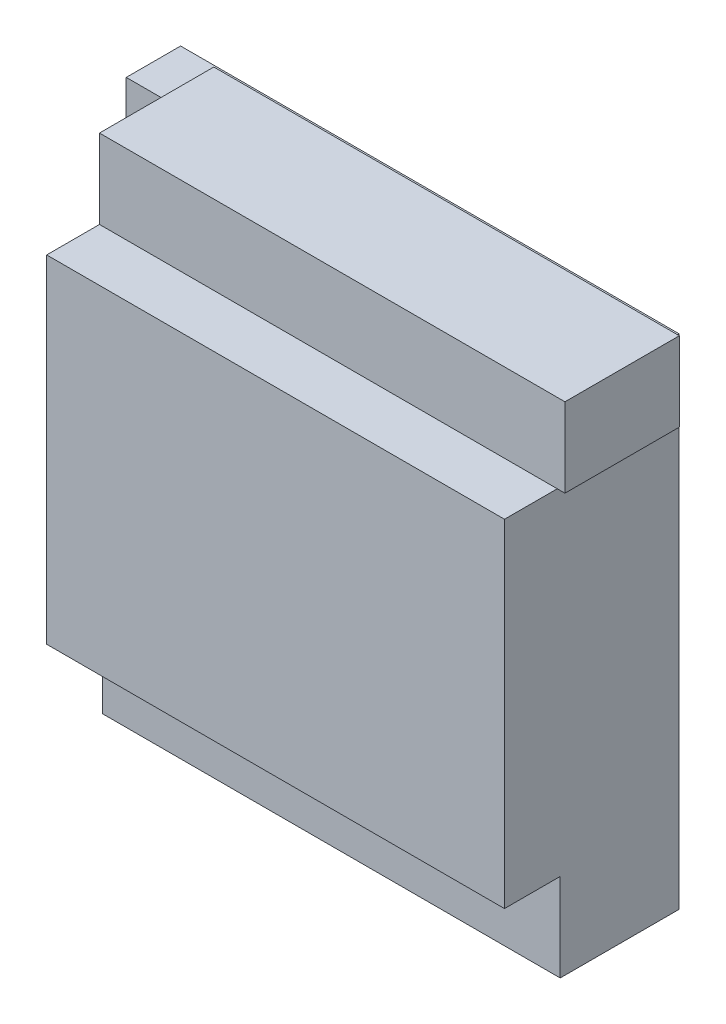
ISO-10303-21;
HEADER;
FILE_DESCRIPTION(('STEP AP214'),'2;1');
FILE_NAME('part.step','',(''),(''),'','','');
FILE_SCHEMA(('AUTOMOTIVE_DESIGN { 1 0 10303 214 1 1 1 1 }'));
ENDSEC;
DATA;
#1=APPLICATION_CONTEXT('core data for automotive mechanical design processes');
#2=APPLICATION_PROTOCOL_DEFINITION('international standard','automotive_design',2000,#1);
#3=PRODUCT_CONTEXT('',#1,'mechanical');
#4=PRODUCT('Part','Part','',(#3));
#5=PRODUCT_RELATED_PRODUCT_CATEGORY('part','',(#4));
#6=PRODUCT_DEFINITION_FORMATION('','',#4);
#7=PRODUCT_DEFINITION_CONTEXT('part definition',#1,'design');
#8=PRODUCT_DEFINITION('design','',#6,#7);
#9=PRODUCT_DEFINITION_SHAPE('','',#8);
#10=(LENGTH_UNIT() NAMED_UNIT(*) SI_UNIT(.MILLI.,.METRE.));
#11=(NAMED_UNIT(*) PLANE_ANGLE_UNIT() SI_UNIT($,.RADIAN.));
#12=(NAMED_UNIT(*) SI_UNIT($,.STERADIAN.) SOLID_ANGLE_UNIT());
#13=UNCERTAINTY_MEASURE_WITH_UNIT(LENGTH_MEASURE(1.E-05),#10,'distance_accuracy_value','');
#14=(GEOMETRIC_REPRESENTATION_CONTEXT(3) GLOBAL_UNCERTAINTY_ASSIGNED_CONTEXT((#13)) GLOBAL_UNIT_ASSIGNED_CONTEXT((#10,
#11,#12)) REPRESENTATION_CONTEXT('',''));
#15=CARTESIAN_POINT('',(0.,0.,0.));
#16=DIRECTION('',(0.,0.,1.));
#17=DIRECTION('',(1.,0.,0.));
#18=AXIS2_PLACEMENT_3D('',#15,#16,#17);
#19=CARTESIAN_POINT('',(-71.13,60.,41.54));
#20=DIRECTION('',(0.,1.,0.));
#21=DIRECTION('',(0.,0.,1.));
#22=AXIS2_PLACEMENT_3D('',#19,#20,#21);
#23=PLANE('',#22);
#24=DIRECTION('',(0.,0.,-1.));
#25=VECTOR('',#24,1.);
#26=CARTESIAN_POINT('',(85.,60.,59.54));
#27=LINE('',#26,#25);
#28=CARTESIAN_POINT('',(84.9999999999999,60.,41.54));
#29=VERTEX_POINT('',#28);
#30=CARTESIAN_POINT('',(84.9999999999999,60.,2.54));
#31=VERTEX_POINT('',#30);
#32=EDGE_CURVE('E531',#29,#31,#27,.T.);
#33=ORIENTED_EDGE('',*,*,#32,.T.);
#34=DIRECTION('',(1.,0.,0.));
#35=VECTOR('',#34,1.);
#36=CARTESIAN_POINT('',(-71.13,60.,2.54));
#37=LINE('',#36,#35);
#38=CARTESIAN_POINT('',(87.62,60.,2.54));
#39=VERTEX_POINT('',#38);
#40=EDGE_CURVE('E463',#31,#39,#37,.T.);
#41=ORIENTED_EDGE('',*,*,#40,.T.);
#42=DIRECTION('',(0.,0.,-1.));
#43=VECTOR('',#42,1.);
#44=CARTESIAN_POINT('',(87.62,60.,41.54));
#45=LINE('',#44,#43);
#46=CARTESIAN_POINT('',(87.62,60.,41.54));
#47=VERTEX_POINT('',#46);
#48=EDGE_CURVE('E476',#47,#39,#45,.T.);
#49=ORIENTED_EDGE('',*,*,#48,.F.);
#50=DIRECTION('',(1.,0.,0.));
#51=VECTOR('',#50,1.);
#52=CARTESIAN_POINT('',(-71.13,60.,41.54));
#53=LINE('',#52,#51);
#54=EDGE_CURVE('E50',#29,#47,#53,.T.);
#55=ORIENTED_EDGE('',*,*,#54,.F.);
#56=EDGE_LOOP('',(#33,#41,#49,#55));
#57=FACE_BOUND('',#56,.T.);
#58=ADVANCED_FACE('F35',(#57),#23,.F.);
#59=CARTESIAN_POINT('',(-71.13,60.,41.54));
#60=DIRECTION('',(1.,0.,0.));
#61=DIRECTION('',(0.,0.,-1.));
#62=AXIS2_PLACEMENT_3D('',#59,#60,#61);
#63=PLANE('',#62);
#64=DIRECTION('',(0.,0.,-1.));
#65=VECTOR('',#64,1.);
#66=CARTESIAN_POINT('',(-71.13,85.,18.54));
#67=LINE('',#66,#65);
#68=CARTESIAN_POINT('',(-71.13,85.,18.54));
#69=VERTEX_POINT('',#68);
#70=CARTESIAN_POINT('',(-71.13,85.,2.54));
#71=VERTEX_POINT('',#70);
#72=EDGE_CURVE('E440',#69,#71,#67,.T.);
#73=ORIENTED_EDGE('',*,*,#72,.F.);
#74=DIRECTION('',(0.,1.,0.));
#75=VECTOR('',#74,1.);
#76=CARTESIAN_POINT('',(-71.13,85.,18.54));
#77=LINE('',#76,#75);
#78=CARTESIAN_POINT('',(-71.13,-85.,18.54));
#79=VERTEX_POINT('',#78);
#80=EDGE_CURVE('E435',#79,#69,#77,.T.);
#81=ORIENTED_EDGE('',*,*,#80,.F.);
#82=DIRECTION('',(0.,0.,-1.));
#83=VECTOR('',#82,1.);
#84=CARTESIAN_POINT('',(-71.13,-85.,40.54));
#85=LINE('',#84,#83);
#86=CARTESIAN_POINT('',(-71.13,-85.,40.54));
#87=VERTEX_POINT('',#86);
#88=EDGE_CURVE('E427',#87,#79,#85,.T.);
#89=ORIENTED_EDGE('',*,*,#88,.F.);
#90=DIRECTION('',(0.,-1.,0.));
#91=VECTOR('',#90,1.);
#92=CARTESIAN_POINT('',(-71.13,-85.,40.54));
#93=LINE('',#92,#91);
#94=CARTESIAN_POINT('',(-71.13,-55.,40.54));
#95=VERTEX_POINT('',#94);
#96=EDGE_CURVE('E421',#95,#87,#93,.T.);
#97=ORIENTED_EDGE('',*,*,#96,.F.);
#98=DIRECTION('',(0.,0.,-1.));
#99=VECTOR('',#98,1.);
#100=CARTESIAN_POINT('',(-71.13,-55.,59.54));
#101=LINE('',#100,#99);
#102=CARTESIAN_POINT('',(-71.13,-55.,59.54));
#103=VERTEX_POINT('',#102);
#104=EDGE_CURVE('E409',#103,#95,#101,.T.);
#105=ORIENTED_EDGE('',*,*,#104,.F.);
#106=DIRECTION('',(0.,-1.,0.));
#107=VECTOR('',#106,1.);
#108=CARTESIAN_POINT('',(-71.13,60.,59.54));
#109=LINE('',#108,#107);
#110=CARTESIAN_POINT('',(-71.13,60.,59.54));
#111=VERTEX_POINT('',#110);
#112=EDGE_CURVE('E543',#111,#103,#109,.T.);
#113=ORIENTED_EDGE('',*,*,#112,.F.);
#114=DIRECTION('',(0.,0.,-1.));
#115=VECTOR('',#114,1.);
#116=CARTESIAN_POINT('',(-71.13,60.,59.54));
#117=LINE('',#116,#115);
#118=CARTESIAN_POINT('',(-71.13,60.,41.54));
#119=VERTEX_POINT('',#118);
#120=EDGE_CURVE('E517',#111,#119,#117,.T.);
#121=ORIENTED_EDGE('',*,*,#120,.T.);
#122=DIRECTION('',(0.,-1.,0.));
#123=VECTOR('',#122,1.);
#124=CARTESIAN_POINT('',(-71.13,60.,41.54));
#125=LINE('',#124,#123);
#126=CARTESIAN_POINT('',(-71.13,87.,41.54));
#127=VERTEX_POINT('',#126);
#128=EDGE_CURVE('E449',#127,#119,#125,.T.);
#129=ORIENTED_EDGE('',*,*,#128,.F.);
#130=DIRECTION('',(0.,0.,-1.));
#131=VECTOR('',#130,1.);
#132=CARTESIAN_POINT('',(-71.13,87.,41.54));
#133=LINE('',#132,#131);
#134=CARTESIAN_POINT('',(-71.13,87.,2.54));
#135=VERTEX_POINT('',#134);
#136=EDGE_CURVE('E461',#127,#135,#133,.T.);
#137=ORIENTED_EDGE('',*,*,#136,.T.);
#138=DIRECTION('',(0.,-1.,0.));
#139=VECTOR('',#138,1.);
#140=CARTESIAN_POINT('',(-71.13,60.,2.54));
#141=LINE('',#140,#139);
#142=EDGE_CURVE('E448',#135,#71,#141,.T.);
#143=ORIENTED_EDGE('',*,*,#142,.T.);
#144=EDGE_LOOP('',(#73,#81,#89,#97,#105,#113,#121,#129,#137,#143));
#145=FACE_BOUND('',#144,.T.);
#146=ADVANCED_FACE('F133',(#145),#63,.F.);
#147=CARTESIAN_POINT('',(0.,0.,0.));
#148=DIRECTION('',(0.,0.,-1.));
#149=DIRECTION('',(-1.,0.,0.));
#150=AXIS2_PLACEMENT_3D('',#147,#148,#149);
#151=PLANE('',#150);
#152=CARTESIAN_POINT('',(-78.65,-80.0999999999998,0.));
#153=DIRECTION('',(0.,0.,1.));
#154=DIRECTION('',(1.,0.,0.));
#155=AXIS2_PLACEMENT_3D('',#152,#153,#154);
#156=CIRCLE('',#155,1.97999999999999);
#157=CARTESIAN_POINT('',(-76.67,-80.0999999999998,0.));
#158=VERTEX_POINT('',#157);
#159=EDGE_CURVE('E482',#158,#158,#156,.T.);
#160=ORIENTED_EDGE('',*,*,#159,.T.);
#161=EDGE_LOOP('',(#160));
#162=FACE_BOUND('',#161,.T.);
#163=CARTESIAN_POINT('',(-78.65,74.84,0.));
#164=DIRECTION('',(0.,0.,1.));
#165=DIRECTION('',(1.,0.,0.));
#166=AXIS2_PLACEMENT_3D('',#163,#164,#165);
#167=CIRCLE('',#166,1.97999999999999);
#168=CARTESIAN_POINT('',(-76.67,74.84,0.));
#169=VERTEX_POINT('',#168);
#170=EDGE_CURVE('E120',#169,#169,#167,.T.);
#171=ORIENTED_EDGE('',*,*,#170,.T.);
#172=EDGE_LOOP('',(#171));
#173=FACE_BOUND('',#172,.T.);
#174=DIRECTION('',(0.,1.,0.));
#175=VECTOR('',#174,1.);
#176=CARTESIAN_POINT('',(85.,-85.,0.));
#177=LINE('',#176,#175);
#178=CARTESIAN_POINT('',(85.,-85.,0.));
#179=VERTEX_POINT('',#178);
#180=CARTESIAN_POINT('',(85.,85.,0.));
#181=VERTEX_POINT('',#180);
#182=EDGE_CURVE('E104',#179,#181,#177,.T.);
#183=ORIENTED_EDGE('',*,*,#182,.F.);
#184=DIRECTION('',(1.,0.,0.));
#185=VECTOR('',#184,1.);
#186=CARTESIAN_POINT('',(-85.,-85.,0.));
#187=LINE('',#186,#185);
#188=CARTESIAN_POINT('',(-85.,-85.,0.));
#189=VERTEX_POINT('',#188);
#190=EDGE_CURVE('E87',#189,#179,#187,.T.);
#191=ORIENTED_EDGE('',*,*,#190,.F.);
#192=DIRECTION('',(0.,-1.,0.));
#193=VECTOR('',#192,1.);
#194=CARTESIAN_POINT('',(-85.,-85.,0.));
#195=LINE('',#194,#193);
#196=CARTESIAN_POINT('',(-85.,85.,0.));
#197=VERTEX_POINT('',#196);
#198=EDGE_CURVE('E77',#197,#189,#195,.T.);
#199=ORIENTED_EDGE('',*,*,#198,.F.);
#200=DIRECTION('',(-1.,0.,0.));
#201=VECTOR('',#200,1.);
#202=CARTESIAN_POINT('',(-85.,85.,0.));
#203=LINE('',#202,#201);
#204=EDGE_CURVE('E88',#181,#197,#203,.T.);
#205=ORIENTED_EDGE('',*,*,#204,.F.);
#206=EDGE_LOOP('',(#183,#191,#199,#205));
#207=FACE_BOUND('',#206,.T.);
#208=CARTESIAN_POINT('',(78.8299999999999,51.98,0.));
#209=DIRECTION('',(0.,0.,1.));
#210=DIRECTION('',(1.,0.,0.));
#211=AXIS2_PLACEMENT_3D('',#208,#209,#210);
#212=CIRCLE('',#211,1.97999999999999);
#213=CARTESIAN_POINT('',(80.8099999999999,51.98,0.));
#214=VERTEX_POINT('',#213);
#215=EDGE_CURVE('E485',#214,#214,#212,.T.);
#216=ORIENTED_EDGE('',*,*,#215,.T.);
#217=EDGE_LOOP('',(#216));
#218=FACE_BOUND('',#217,.T.);
#219=CARTESIAN_POINT('',(78.8299999999999,-80.0999999999998,0.));
#220=DIRECTION('',(0.,0.,1.));
#221=DIRECTION('',(1.,0.,0.));
#222=AXIS2_PLACEMENT_3D('',#219,#220,#221);
#223=CIRCLE('',#222,1.97999999999999);
#224=CARTESIAN_POINT('',(80.8099999999999,-80.0999999999998,0.));
#225=VERTEX_POINT('',#224);
#226=EDGE_CURVE('E479',#225,#225,#223,.T.);
#227=ORIENTED_EDGE('',*,*,#226,.T.);
#228=EDGE_LOOP('',(#227));
#229=FACE_BOUND('',#228,.T.);
#230=ADVANCED_FACE('F101',(#162,#173,#207,#218,#229),#151,.T.);
#231=CARTESIAN_POINT('',(85.,-85.,2.54));
#232=DIRECTION('',(-1.,0.,0.));
#233=DIRECTION('',(0.,0.,1.));
#234=AXIS2_PLACEMENT_3D('',#231,#232,#233);
#235=PLANE('',#234);
#236=DIRECTION('',(0.,1.,0.));
#237=VECTOR('',#236,1.);
#238=CARTESIAN_POINT('',(85.,-85.,2.54));
#239=LINE('',#238,#237);
#240=CARTESIAN_POINT('',(85.,85.,2.54));
#241=VERTEX_POINT('',#240);
#242=EDGE_CURVE('E105',#31,#241,#239,.T.);
#243=ORIENTED_EDGE('',*,*,#242,.F.);
#244=ORIENTED_EDGE('',*,*,#32,.F.);
#245=CARTESIAN_POINT('',(85.,60.,59.54));
#246=VERTEX_POINT('',#245);
#247=EDGE_CURVE('E526',#246,#29,#27,.T.);
#248=ORIENTED_EDGE('',*,*,#247,.F.);
#249=DIRECTION('',(0.,1.,0.));
#250=VECTOR('',#249,1.);
#251=CARTESIAN_POINT('',(85.,60.,59.54));
#252=LINE('',#251,#250);
#253=CARTESIAN_POINT('',(85.,-55.,59.54));
#254=VERTEX_POINT('',#253);
#255=EDGE_CURVE('E537',#254,#246,#252,.T.);
#256=ORIENTED_EDGE('',*,*,#255,.F.);
#257=DIRECTION('',(0.,0.,-1.));
#258=VECTOR('',#257,1.);
#259=CARTESIAN_POINT('',(85.,-55.,59.54));
#260=LINE('',#259,#258);
#261=CARTESIAN_POINT('',(85.,-55.,40.54));
#262=VERTEX_POINT('',#261);
#263=EDGE_CURVE('E415',#254,#262,#260,.T.);
#264=ORIENTED_EDGE('',*,*,#263,.T.);
#265=DIRECTION('',(0.,1.,0.));
#266=VECTOR('',#265,1.);
#267=CARTESIAN_POINT('',(85.,-85.,40.54));
#268=LINE('',#267,#266);
#269=CARTESIAN_POINT('',(85.,-85.,40.54));
#270=VERTEX_POINT('',#269);
#271=EDGE_CURVE('E408',#270,#262,#268,.T.);
#272=ORIENTED_EDGE('',*,*,#271,.F.);
#273=DIRECTION('',(0.,0.,-1.));
#274=VECTOR('',#273,1.);
#275=CARTESIAN_POINT('',(85.,-85.,2.54));
#276=LINE('',#275,#274);
#277=EDGE_CURVE('E98',#270,#179,#276,.T.);
#278=ORIENTED_EDGE('',*,*,#277,.T.);
#279=ORIENTED_EDGE('',*,*,#182,.T.);
#280=DIRECTION('',(0.,0.,-1.));
#281=VECTOR('',#280,1.);
#282=CARTESIAN_POINT('',(85.,85.,2.54));
#283=LINE('',#282,#281);
#284=EDGE_CURVE('E11',#241,#181,#283,.T.);
#285=ORIENTED_EDGE('',*,*,#284,.F.);
#286=EDGE_LOOP('',(#243,#244,#248,#256,#264,#272,#278,#279,#285));
#287=FACE_BOUND('',#286,.T.);
#288=ADVANCED_FACE('F37',(#287),#235,.F.);
#289=CARTESIAN_POINT('',(-85.,85.,2.54));
#290=DIRECTION('',(0.,-1.,0.));
#291=DIRECTION('',(0.,0.,-1.));
#292=AXIS2_PLACEMENT_3D('',#289,#290,#291);
#293=PLANE('',#292);
#294=ORIENTED_EDGE('',*,*,#204,.T.);
#295=DIRECTION('',(0.,0.,-1.));
#296=VECTOR('',#295,1.);
#297=CARTESIAN_POINT('',(-85.,85.,2.54));
#298=LINE('',#297,#296);
#299=CARTESIAN_POINT('',(-85.,85.,18.54));
#300=VERTEX_POINT('',#299);
#301=EDGE_CURVE('E43',#300,#197,#298,.T.);
#302=ORIENTED_EDGE('',*,*,#301,.F.);
#303=DIRECTION('',(-1.,0.,0.));
#304=VECTOR('',#303,1.);
#305=CARTESIAN_POINT('',(-85.,85.,18.54));
#306=LINE('',#305,#304);
#307=EDGE_CURVE('E438',#69,#300,#306,.T.);
#308=ORIENTED_EDGE('',*,*,#307,.F.);
#309=ORIENTED_EDGE('',*,*,#72,.T.);
#310=DIRECTION('',(-1.,0.,0.));
#311=VECTOR('',#310,1.);
#312=CARTESIAN_POINT('',(-85.,85.,2.54));
#313=LINE('',#312,#311);
#314=EDGE_CURVE('E58',#241,#71,#313,.T.);
#315=ORIENTED_EDGE('',*,*,#314,.F.);
#316=ORIENTED_EDGE('',*,*,#284,.T.);
#317=EDGE_LOOP('',(#294,#302,#308,#309,#315,#316));
#318=FACE_BOUND('',#317,.T.);
#319=ADVANCED_FACE('F121',(#318),#293,.F.);
#320=CARTESIAN_POINT('',(-85.,-85.,2.54));
#321=DIRECTION('',(1.,0.,0.));
#322=DIRECTION('',(0.,0.,-1.));
#323=AXIS2_PLACEMENT_3D('',#320,#321,#322);
#324=PLANE('',#323);
#325=ORIENTED_EDGE('',*,*,#198,.T.);
#326=DIRECTION('',(0.,0.,-1.));
#327=VECTOR('',#326,1.);
#328=CARTESIAN_POINT('',(-85.,-85.,2.54));
#329=LINE('',#328,#327);
#330=CARTESIAN_POINT('',(-85.,-85.,18.54));
#331=VERTEX_POINT('',#330);
#332=EDGE_CURVE('E82',#331,#189,#329,.T.);
#333=ORIENTED_EDGE('',*,*,#332,.F.);
#334=DIRECTION('',(0.,-1.,0.));
#335=VECTOR('',#334,1.);
#336=CARTESIAN_POINT('',(-85.,85.,18.54));
#337=LINE('',#336,#335);
#338=EDGE_CURVE('E432',#300,#331,#337,.T.);
#339=ORIENTED_EDGE('',*,*,#338,.F.);
#340=ORIENTED_EDGE('',*,*,#301,.T.);
#341=EDGE_LOOP('',(#325,#333,#339,#340));
#342=FACE_BOUND('',#341,.T.);
#343=ADVANCED_FACE('F79',(#342),#324,.F.);
#344=CARTESIAN_POINT('',(-85.,-85.,2.54));
#345=DIRECTION('',(0.,1.,0.));
#346=DIRECTION('',(0.,0.,1.));
#347=AXIS2_PLACEMENT_3D('',#344,#345,#346);
#348=PLANE('',#347);
#349=ORIENTED_EDGE('',*,*,#277,.F.);
#350=DIRECTION('',(1.,0.,0.));
#351=VECTOR('',#350,1.);
#352=CARTESIAN_POINT('',(85.,-85.,40.54));
#353=LINE('',#352,#351);
#354=EDGE_CURVE('E424',#87,#270,#353,.T.);
#355=ORIENTED_EDGE('',*,*,#354,.F.);
#356=ORIENTED_EDGE('',*,*,#88,.T.);
#357=DIRECTION('',(1.,0.,0.));
#358=VECTOR('',#357,1.);
#359=CARTESIAN_POINT('',(-85.,-85.,18.54));
#360=LINE('',#359,#358);
#361=EDGE_CURVE('E96',#331,#79,#360,.T.);
#362=ORIENTED_EDGE('',*,*,#361,.F.);
#363=ORIENTED_EDGE('',*,*,#332,.T.);
#364=ORIENTED_EDGE('',*,*,#190,.T.);
#365=EDGE_LOOP('',(#349,#355,#356,#362,#363,#364));
#366=FACE_BOUND('',#365,.T.);
#367=ADVANCED_FACE('F92',(#366),#348,.F.);
#368=CARTESIAN_POINT('',(-78.65,74.84,2.54));
#369=DIRECTION('',(0.,0.,-1.));
#370=DIRECTION('',(-1.,0.,0.));
#371=AXIS2_PLACEMENT_3D('',#368,#369,#370);
#372=CYLINDRICAL_SURFACE('',#371,1.97999999999999);
#373=CARTESIAN_POINT('',(-78.65,74.84,2.54));
#374=DIRECTION('',(0.,0.,1.));
#375=DIRECTION('',(1.,0.,0.));
#376=AXIS2_PLACEMENT_3D('',#373,#374,#375);
#377=CIRCLE('',#376,1.97999999999999);
#378=CARTESIAN_POINT('',(-76.67,74.84,2.54));
#379=VERTEX_POINT('',#378);
#380=EDGE_CURVE('E445',#379,#379,#377,.T.);
#381=ORIENTED_EDGE('',*,*,#380,.T.);
#382=EDGE_LOOP('',(#381));
#383=FACE_BOUND('',#382,.T.);
#384=ORIENTED_EDGE('',*,*,#170,.F.);
#385=EDGE_LOOP('',(#384));
#386=FACE_BOUND('',#385,.T.);
#387=ADVANCED_FACE('F158',(#383,#386),#372,.F.);
#388=CARTESIAN_POINT('',(78.8299999999999,51.98,2.54));
#389=DIRECTION('',(0.,0.,-1.));
#390=DIRECTION('',(-1.,0.,0.));
#391=AXIS2_PLACEMENT_3D('',#388,#389,#390);
#392=CYLINDRICAL_SURFACE('',#391,1.97999999999999);
#393=CARTESIAN_POINT('',(78.8299999999999,51.98,2.54));
#394=DIRECTION('',(0.,0.,1.));
#395=DIRECTION('',(1.,0.,0.));
#396=AXIS2_PLACEMENT_3D('',#393,#394,#395);
#397=CIRCLE('',#396,1.97999999999999);
#398=CARTESIAN_POINT('',(80.8099999999999,51.98,2.54));
#399=VERTEX_POINT('',#398);
#400=EDGE_CURVE('E407',#399,#399,#397,.T.);
#401=ORIENTED_EDGE('',*,*,#400,.T.);
#402=EDGE_LOOP('',(#401));
#403=FACE_BOUND('',#402,.T.);
#404=ORIENTED_EDGE('',*,*,#215,.F.);
#405=EDGE_LOOP('',(#404));
#406=FACE_BOUND('',#405,.T.);
#407=ADVANCED_FACE('F154',(#403,#406),#392,.F.);
#408=CARTESIAN_POINT('',(-78.65,-80.0999999999998,2.54));
#409=DIRECTION('',(0.,0.,-1.));
#410=DIRECTION('',(-1.,0.,0.));
#411=AXIS2_PLACEMENT_3D('',#408,#409,#410);
#412=CYLINDRICAL_SURFACE('',#411,1.97999999999999);
#413=CARTESIAN_POINT('',(-78.65,-80.0999999999998,2.54));
#414=DIRECTION('',(0.,0.,1.));
#415=DIRECTION('',(1.,0.,0.));
#416=AXIS2_PLACEMENT_3D('',#413,#414,#415);
#417=CIRCLE('',#416,1.97999999999999);
#418=CARTESIAN_POINT('',(-76.67,-80.0999999999998,2.54));
#419=VERTEX_POINT('',#418);
#420=EDGE_CURVE('E442',#419,#419,#417,.T.);
#421=ORIENTED_EDGE('',*,*,#420,.T.);
#422=EDGE_LOOP('',(#421));
#423=FACE_BOUND('',#422,.T.);
#424=ORIENTED_EDGE('',*,*,#159,.F.);
#425=EDGE_LOOP('',(#424));
#426=FACE_BOUND('',#425,.T.);
#427=ADVANCED_FACE('F150',(#423,#426),#412,.F.);
#428=CARTESIAN_POINT('',(78.8299999999999,-80.0999999999998,2.54));
#429=DIRECTION('',(0.,0.,-1.));
#430=DIRECTION('',(-1.,0.,0.));
#431=AXIS2_PLACEMENT_3D('',#428,#429,#430);
#432=CYLINDRICAL_SURFACE('',#431,1.97999999999999);
#433=CARTESIAN_POINT('',(78.8299999999999,-80.0999999999998,2.54));
#434=DIRECTION('',(0.,0.,1.));
#435=DIRECTION('',(1.,0.,0.));
#436=AXIS2_PLACEMENT_3D('',#433,#434,#435);
#437=CIRCLE('',#436,1.97999999999999);
#438=CARTESIAN_POINT('',(80.8099999999999,-80.0999999999998,2.54));
#439=VERTEX_POINT('',#438);
#440=EDGE_CURVE('E429',#439,#439,#437,.T.);
#441=ORIENTED_EDGE('',*,*,#440,.T.);
#442=EDGE_LOOP('',(#441));
#443=FACE_BOUND('',#442,.T.);
#444=ORIENTED_EDGE('',*,*,#226,.F.);
#445=EDGE_LOOP('',(#444));
#446=FACE_BOUND('',#445,.T.);
#447=ADVANCED_FACE('F147',(#443,#446),#432,.F.);
#448=CARTESIAN_POINT('',(87.62,60.,41.54));
#449=DIRECTION('',(-1.,0.,0.));
#450=DIRECTION('',(0.,0.,1.));
#451=AXIS2_PLACEMENT_3D('',#448,#449,#450);
#452=PLANE('',#451);
#453=DIRECTION('',(0.,1.,0.));
#454=VECTOR('',#453,1.);
#455=CARTESIAN_POINT('',(87.62,60.,2.54));
#456=LINE('',#455,#454);
#457=CARTESIAN_POINT('',(87.62,87.,2.54));
#458=VERTEX_POINT('',#457);
#459=EDGE_CURVE('E466',#39,#458,#456,.T.);
#460=ORIENTED_EDGE('',*,*,#459,.T.);
#461=DIRECTION('',(0.,0.,-1.));
#462=VECTOR('',#461,1.);
#463=CARTESIAN_POINT('',(87.62,87.,41.54));
#464=LINE('',#463,#462);
#465=CARTESIAN_POINT('',(87.62,87.,41.54));
#466=VERTEX_POINT('',#465);
#467=EDGE_CURVE('E473',#466,#458,#464,.T.);
#468=ORIENTED_EDGE('',*,*,#467,.F.);
#469=DIRECTION('',(0.,1.,0.));
#470=VECTOR('',#469,1.);
#471=CARTESIAN_POINT('',(87.62,60.,41.54));
#472=LINE('',#471,#470);
#473=EDGE_CURVE('E455',#47,#466,#472,.T.);
#474=ORIENTED_EDGE('',*,*,#473,.F.);
#475=ORIENTED_EDGE('',*,*,#48,.T.);
#476=EDGE_LOOP('',(#460,#468,#474,#475));
#477=FACE_BOUND('',#476,.T.);
#478=ADVANCED_FACE('F144',(#477),#452,.F.);
#479=CARTESIAN_POINT('',(-71.13,87.,41.54));
#480=DIRECTION('',(0.,-1.,0.));
#481=DIRECTION('',(0.,0.,-1.));
#482=AXIS2_PLACEMENT_3D('',#479,#480,#481);
#483=PLANE('',#482);
#484=DIRECTION('',(-1.,0.,0.));
#485=VECTOR('',#484,1.);
#486=CARTESIAN_POINT('',(-71.13,87.,2.54));
#487=LINE('',#486,#485);
#488=EDGE_CURVE('E452',#458,#135,#487,.T.);
#489=ORIENTED_EDGE('',*,*,#488,.T.);
#490=ORIENTED_EDGE('',*,*,#136,.F.);
#491=DIRECTION('',(-1.,0.,0.));
#492=VECTOR('',#491,1.);
#493=CARTESIAN_POINT('',(-71.13,87.,41.54));
#494=LINE('',#493,#492);
#495=EDGE_CURVE('E458',#466,#127,#494,.T.);
#496=ORIENTED_EDGE('',*,*,#495,.F.);
#497=ORIENTED_EDGE('',*,*,#467,.T.);
#498=EDGE_LOOP('',(#489,#490,#496,#497));
#499=FACE_BOUND('',#498,.T.);
#500=ADVANCED_FACE('F198',(#499),#483,.F.);
#501=CARTESIAN_POINT('',(0.,0.,41.54));
#502=DIRECTION('',(0.,0.,-1.));
#503=DIRECTION('',(-1.,0.,0.));
#504=AXIS2_PLACEMENT_3D('',#501,#502,#503);
#505=PLANE('',#504);
#506=ORIENTED_EDGE('',*,*,#128,.T.);
#507=EDGE_CURVE('E453',#119,#29,#53,.T.);
#508=ORIENTED_EDGE('',*,*,#507,.T.);
#509=ORIENTED_EDGE('',*,*,#54,.T.);
#510=ORIENTED_EDGE('',*,*,#473,.T.);
#511=ORIENTED_EDGE('',*,*,#495,.T.);
#512=EDGE_LOOP('',(#506,#508,#509,#510,#511));
#513=FACE_BOUND('',#512,.T.);
#514=ADVANCED_FACE('F204',(#513),#505,.F.);
#515=CARTESIAN_POINT('',(0.,0.,2.54));
#516=DIRECTION('',(0.,0.,-1.));
#517=DIRECTION('',(-1.,0.,0.));
#518=AXIS2_PLACEMENT_3D('',#515,#516,#517);
#519=PLANE('',#518);
#520=ORIENTED_EDGE('',*,*,#40,.F.);
#521=ORIENTED_EDGE('',*,*,#242,.T.);
#522=ORIENTED_EDGE('',*,*,#314,.T.);
#523=ORIENTED_EDGE('',*,*,#142,.F.);
#524=ORIENTED_EDGE('',*,*,#488,.F.);
#525=ORIENTED_EDGE('',*,*,#459,.F.);
#526=EDGE_LOOP('',(#520,#521,#522,#523,#524,#525));
#527=FACE_BOUND('',#526,.T.);
#528=ADVANCED_FACE('F212',(#527),#519,.T.);
#529=CARTESIAN_POINT('',(0.,0.,18.54));
#530=DIRECTION('',(0.,0.,1.));
#531=DIRECTION('',(1.,0.,0.));
#532=AXIS2_PLACEMENT_3D('',#529,#530,#531);
#533=PLANE('',#532);
#534=ORIENTED_EDGE('',*,*,#338,.T.);
#535=ORIENTED_EDGE('',*,*,#361,.T.);
#536=ORIENTED_EDGE('',*,*,#80,.T.);
#537=ORIENTED_EDGE('',*,*,#307,.T.);
#538=EDGE_LOOP('',(#534,#535,#536,#537));
#539=FACE_BOUND('',#538,.T.);
#540=ADVANCED_FACE('F221',(#539),#533,.T.);
#541=CARTESIAN_POINT('',(0.,0.,2.54));
#542=DIRECTION('',(0.,0.,1.));
#543=DIRECTION('',(1.,0.,0.));
#544=AXIS2_PLACEMENT_3D('',#541,#542,#543);
#545=PLANE('',#544);
#546=ORIENTED_EDGE('',*,*,#420,.F.);
#547=EDGE_LOOP('',(#546));
#548=FACE_BOUND('',#547,.T.);
#549=ADVANCED_FACE('F229',(#548),#545,.F.);
#550=ORIENTED_EDGE('',*,*,#380,.F.);
#551=EDGE_LOOP('',(#550));
#552=FACE_BOUND('',#551,.T.);
#553=ADVANCED_FACE('F238',(#552),#545,.F.);
#554=CARTESIAN_POINT('',(0.,0.,40.54));
#555=DIRECTION('',(0.,0.,1.));
#556=DIRECTION('',(1.,0.,0.));
#557=AXIS2_PLACEMENT_3D('',#554,#555,#556);
#558=PLANE('',#557);
#559=ORIENTED_EDGE('',*,*,#271,.T.);
#560=DIRECTION('',(-1.,0.,0.));
#561=VECTOR('',#560,1.);
#562=CARTESIAN_POINT('',(85.,-55.,40.54));
#563=LINE('',#562,#561);
#564=EDGE_CURVE('E412',#262,#95,#563,.T.);
#565=ORIENTED_EDGE('',*,*,#564,.T.);
#566=ORIENTED_EDGE('',*,*,#96,.T.);
#567=ORIENTED_EDGE('',*,*,#354,.T.);
#568=EDGE_LOOP('',(#559,#565,#566,#567));
#569=FACE_BOUND('',#568,.T.);
#570=ADVANCED_FACE('F246',(#569),#558,.T.);
#571=CARTESIAN_POINT('',(0.,0.,2.54));
#572=DIRECTION('',(0.,0.,1.));
#573=DIRECTION('',(1.,0.,0.));
#574=AXIS2_PLACEMENT_3D('',#571,#572,#573);
#575=PLANE('',#574);
#576=ORIENTED_EDGE('',*,*,#440,.F.);
#577=EDGE_LOOP('',(#576));
#578=FACE_BOUND('',#577,.T.);
#579=ADVANCED_FACE('F252',(#578),#575,.F.);
#580=CARTESIAN_POINT('',(0.,0.,59.54));
#581=DIRECTION('',(0.,0.,1.));
#582=DIRECTION('',(1.,0.,0.));
#583=AXIS2_PLACEMENT_3D('',#580,#581,#582);
#584=PLANE('',#583);
#585=ORIENTED_EDGE('',*,*,#112,.T.);
#586=DIRECTION('',(1.,0.,0.));
#587=VECTOR('',#586,1.);
#588=CARTESIAN_POINT('',(-71.13,-55.,59.54));
#589=LINE('',#588,#587);
#590=EDGE_CURVE('E540',#103,#254,#589,.T.);
#591=ORIENTED_EDGE('',*,*,#590,.T.);
#592=ORIENTED_EDGE('',*,*,#255,.T.);
#593=DIRECTION('',(-1.,0.,0.));
#594=VECTOR('',#593,1.);
#595=CARTESIAN_POINT('',(-71.13,60.,59.54));
#596=LINE('',#595,#594);
#597=EDGE_CURVE('E529',#246,#111,#596,.T.);
#598=ORIENTED_EDGE('',*,*,#597,.T.);
#599=EDGE_LOOP('',(#585,#591,#592,#598));
#600=FACE_BOUND('',#599,.T.);
#601=ADVANCED_FACE('F261',(#600),#584,.T.);
#602=CARTESIAN_POINT('',(-71.13,-55.,59.54));
#603=DIRECTION('',(0.,1.,0.));
#604=DIRECTION('',(0.,0.,1.));
#605=AXIS2_PLACEMENT_3D('',#602,#603,#604);
#606=PLANE('',#605);
#607=ORIENTED_EDGE('',*,*,#564,.F.);
#608=ORIENTED_EDGE('',*,*,#263,.F.);
#609=ORIENTED_EDGE('',*,*,#590,.F.);
#610=ORIENTED_EDGE('',*,*,#104,.T.);
#611=EDGE_LOOP('',(#607,#608,#609,#610));
#612=FACE_BOUND('',#611,.T.);
#613=ADVANCED_FACE('F269',(#612),#606,.F.);
#614=CARTESIAN_POINT('',(-71.13,60.,59.54));
#615=DIRECTION('',(0.,-1.,0.));
#616=DIRECTION('',(0.,0.,-1.));
#617=AXIS2_PLACEMENT_3D('',#614,#615,#616);
#618=PLANE('',#617);
#619=ORIENTED_EDGE('',*,*,#247,.T.);
#620=ORIENTED_EDGE('',*,*,#507,.F.);
#621=ORIENTED_EDGE('',*,*,#120,.F.);
#622=ORIENTED_EDGE('',*,*,#597,.F.);
#623=EDGE_LOOP('',(#619,#620,#621,#622));
#624=FACE_BOUND('',#623,.T.);
#625=ADVANCED_FACE('F277',(#624),#618,.F.);
#626=CARTESIAN_POINT('',(0.,0.,2.54));
#627=DIRECTION('',(0.,0.,1.));
#628=DIRECTION('',(1.,0.,0.));
#629=AXIS2_PLACEMENT_3D('',#626,#627,#628);
#630=PLANE('',#629);
#631=ORIENTED_EDGE('',*,*,#400,.F.);
#632=EDGE_LOOP('',(#631));
#633=FACE_BOUND('',#632,.T.);
#634=ADVANCED_FACE('F284',(#633),#630,.F.);
#635=CLOSED_SHELL('',(#58,#146,#230,#288,#319,#343,#367,#387,#407,#427,#447,#478,#500,#514,#528,
#540,#549,#553,#570,#579,#601,#613,#625,#634));
#636=MANIFOLD_SOLID_BREP('B2',#635);
#637=ADVANCED_BREP_SHAPE_REPRESENTATION('',(#18,#636),#14);
#638=SHAPE_DEFINITION_REPRESENTATION(#9,#637);
ENDSEC;
END-ISO-10303-21;
